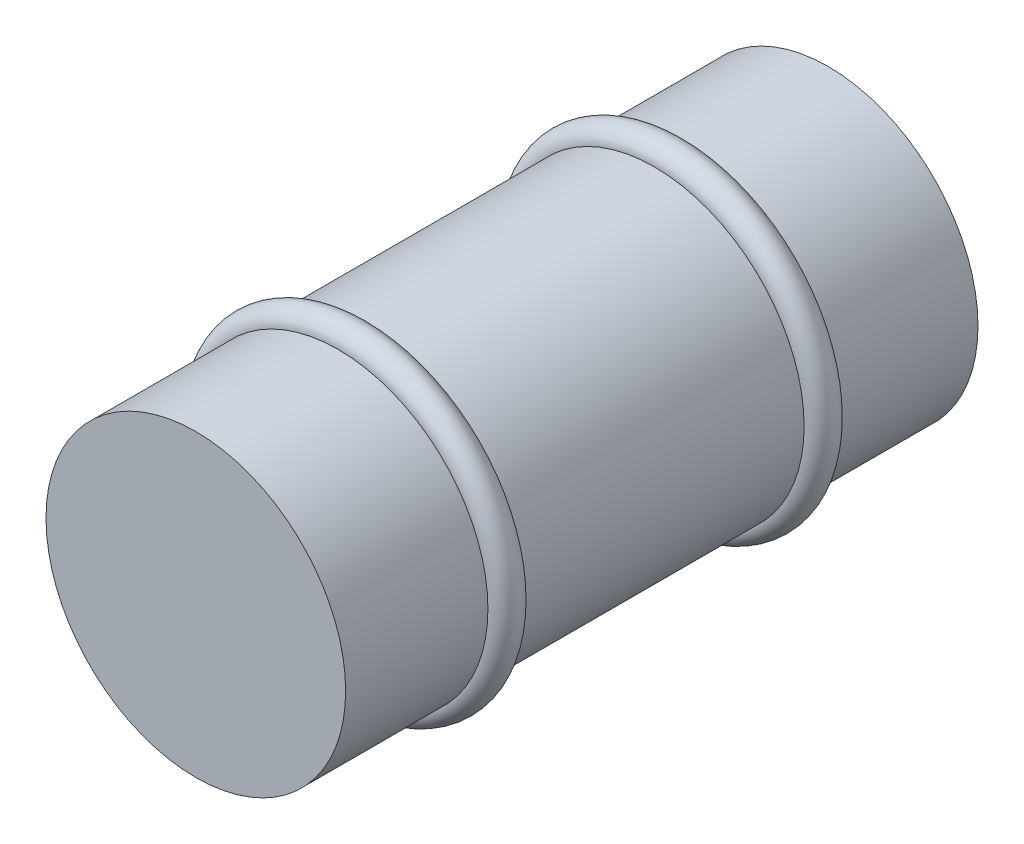
ISO-10303-21;
HEADER;
FILE_DESCRIPTION(('STEP AP214'),'2;1');
FILE_NAME('part.step','',(''),(''),'','','');
FILE_SCHEMA(('AUTOMOTIVE_DESIGN { 1 0 10303 214 1 1 1 1 }'));
ENDSEC;
DATA;
#1=APPLICATION_CONTEXT('core data for automotive mechanical design processes');
#2=APPLICATION_PROTOCOL_DEFINITION('international standard','automotive_design',2000,#1);
#3=PRODUCT_CONTEXT('',#1,'mechanical');
#4=PRODUCT('Part','Part','',(#3));
#5=PRODUCT_RELATED_PRODUCT_CATEGORY('part','',(#4));
#6=PRODUCT_DEFINITION_FORMATION('','',#4);
#7=PRODUCT_DEFINITION_CONTEXT('part definition',#1,'design');
#8=PRODUCT_DEFINITION('design','',#6,#7);
#9=PRODUCT_DEFINITION_SHAPE('','',#8);
#10=(LENGTH_UNIT() NAMED_UNIT(*) SI_UNIT(.MILLI.,.METRE.));
#11=(NAMED_UNIT(*) PLANE_ANGLE_UNIT() SI_UNIT($,.RADIAN.));
#12=(NAMED_UNIT(*) SI_UNIT($,.STERADIAN.) SOLID_ANGLE_UNIT());
#13=UNCERTAINTY_MEASURE_WITH_UNIT(LENGTH_MEASURE(1.E-05),#10,'distance_accuracy_value','');
#14=(GEOMETRIC_REPRESENTATION_CONTEXT(3) GLOBAL_UNCERTAINTY_ASSIGNED_CONTEXT((#13)) GLOBAL_UNIT_ASSIGNED_CONTEXT((#10,
#11,#12)) REPRESENTATION_CONTEXT('',''));
#15=CARTESIAN_POINT('',(0.,0.,0.));
#16=DIRECTION('',(0.,0.,1.));
#17=DIRECTION('',(1.,0.,0.));
#18=AXIS2_PLACEMENT_3D('',#15,#16,#17);
#19=CARTESIAN_POINT('',(0.,0.,25.));
#20=DIRECTION('',(0.,0.,1.));
#21=DIRECTION('',(1.,0.,0.));
#22=AXIS2_PLACEMENT_3D('',#19,#20,#21);
#23=TOROIDAL_SURFACE('',#22,23.6929461454703,2.5);
#24=CARTESIAN_POINT('',(23.6929461454703,0.,25.));
#25=DIRECTION('',(0.,1.,0.));
#26=DIRECTION('',(0.,0.,1.));
#27=AXIS2_PLACEMENT_3D('',#24,#25,#26);
#28=CIRCLE('',#27,2.5);
#29=CARTESIAN_POINT('',(26.1929461454703,0.,25.));
#30=VERTEX_POINT('',#29);
#31=EDGE_CURVE('E11',#30,#30,#28,.T.);
#32=CARTESIAN_POINT('',(0.,0.,25.));
#33=DIRECTION('',(0.,0.,1.));
#34=DIRECTION('',(1.,0.,0.));
#35=AXIS2_PLACEMENT_3D('',#32,#33,#34);
#36=CIRCLE('',#35,26.1929461454703);
#37=EDGE_CURVE('',#30,#30,#36,.T.);
#38=ORIENTED_EDGE('',*,*,#31,.T.);
#39=ORIENTED_EDGE('',*,*,#31,.F.);
#40=ORIENTED_EDGE('',*,*,#37,.T.);
#41=ORIENTED_EDGE('',*,*,#37,.F.);
#42=EDGE_LOOP('',(#38,#40,#39,#41));
#43=FACE_BOUND('',#42,.T.);
#44=ADVANCED_FACE('F42',(#43),#23,.T.);
#45=CLOSED_SHELL('',(#44));
#46=MANIFOLD_SOLID_BREP('B2',#45);
#47=CARTESIAN_POINT('',(0.,0.,75.));
#48=DIRECTION('',(0.,0.,1.));
#49=DIRECTION('',(1.,0.,0.));
#50=AXIS2_PLACEMENT_3D('',#47,#48,#49);
#51=TOROIDAL_SURFACE('',#50,23.6929461454703,2.5);
#52=CARTESIAN_POINT('',(23.6929461454703,0.,75.));
#53=DIRECTION('',(0.,1.,0.));
#54=DIRECTION('',(0.,0.,1.));
#55=AXIS2_PLACEMENT_3D('',#52,#53,#54);
#56=CIRCLE('',#55,2.5);
#57=CARTESIAN_POINT('',(26.1929461454703,0.,75.));
#58=VERTEX_POINT('',#57);
#59=EDGE_CURVE('E41',#58,#58,#56,.T.);
#60=CARTESIAN_POINT('',(0.,0.,75.));
#61=DIRECTION('',(0.,0.,1.));
#62=DIRECTION('',(1.,0.,0.));
#63=AXIS2_PLACEMENT_3D('',#60,#61,#62);
#64=CIRCLE('',#63,26.1929461454703);
#65=EDGE_CURVE('',#58,#58,#64,.T.);
#66=ORIENTED_EDGE('',*,*,#59,.T.);
#67=ORIENTED_EDGE('',*,*,#59,.F.);
#68=ORIENTED_EDGE('',*,*,#65,.T.);
#69=ORIENTED_EDGE('',*,*,#65,.F.);
#70=EDGE_LOOP('',(#66,#68,#67,#69));
#71=FACE_BOUND('',#70,.T.);
#72=ADVANCED_FACE('F70',(#71),#51,.T.);
#73=CLOSED_SHELL('',(#72));
#74=MANIFOLD_SOLID_BREP('B6',#73);
#75=CARTESIAN_POINT('',(0.,0.,100.));
#76=DIRECTION('',(0.,0.,-1.));
#77=DIRECTION('',(-1.,0.,0.));
#78=AXIS2_PLACEMENT_3D('',#75,#76,#77);
#79=CYLINDRICAL_SURFACE('',#78,23.6929461454703);
#80=CARTESIAN_POINT('',(0.,0.,77.5));
#81=DIRECTION('',(0.,0.,-1.));
#82=DIRECTION('',(-1.,0.,0.));
#83=AXIS2_PLACEMENT_3D('',#80,#81,#82);
#84=CIRCLE('',#83,23.6929461454703);
#85=CARTESIAN_POINT('',(23.6929461454703,0.,77.5));
#86=VERTEX_POINT('',#85);
#87=EDGE_CURVE('E68',#86,#86,#84,.F.);
#88=ORIENTED_EDGE('',*,*,#87,.T.);
#89=EDGE_LOOP('',(#88));
#90=FACE_BOUND('',#89,.T.);
#91=CARTESIAN_POINT('',(0.,0.,100.));
#92=DIRECTION('',(0.,0.,1.));
#93=DIRECTION('',(1.,0.,0.));
#94=AXIS2_PLACEMENT_3D('',#91,#92,#93);
#95=CIRCLE('',#94,23.6929461454703);
#96=CARTESIAN_POINT('',(23.6929461454703,0.,100.));
#97=VERTEX_POINT('',#96);
#98=EDGE_CURVE('E108',#97,#97,#95,.T.);
#99=ORIENTED_EDGE('',*,*,#98,.F.);
#100=EDGE_LOOP('',(#99));
#101=FACE_BOUND('',#100,.T.);
#102=ADVANCED_FACE('F87',(#90,#101),#79,.T.);
#103=CARTESIAN_POINT('',(0.,0.,100.));
#104=DIRECTION('',(0.,0.,1.));
#105=DIRECTION('',(1.,0.,0.));
#106=AXIS2_PLACEMENT_3D('',#103,#104,#105);
#107=PLANE('',#106);
#108=ORIENTED_EDGE('',*,*,#98,.T.);
#109=EDGE_LOOP('',(#108));
#110=FACE_BOUND('',#109,.T.);
#111=ADVANCED_FACE('F122',(#110),#107,.T.);
#112=CARTESIAN_POINT('',(0.,0.,75.));
#113=DIRECTION('',(0.,0.,1.));
#114=DIRECTION('',(1.,0.,0.));
#115=AXIS2_PLACEMENT_3D('',#112,#113,#114);
#116=TOROIDAL_SURFACE('',#115,23.6929461454703,2.5);
#117=CARTESIAN_POINT('',(23.6929461454703,0.,75.));
#118=DIRECTION('',(0.,1.,0.));
#119=DIRECTION('',(0.,0.,1.));
#120=AXIS2_PLACEMENT_3D('',#117,#118,#119);
#121=CIRCLE('',#120,2.5);
#122=CARTESIAN_POINT('',(23.6929461454703,0.,72.5));
#123=VERTEX_POINT('',#122);
#124=EDGE_CURVE('E102',#123,#86,#121,.T.);
#125=ORIENTED_EDGE('',*,*,#124,.F.);
#126=CARTESIAN_POINT('',(0.,0.,72.5));
#127=DIRECTION('',(0.,0.,1.));
#128=DIRECTION('',(1.,0.,0.));
#129=AXIS2_PLACEMENT_3D('',#126,#127,#128);
#130=CIRCLE('',#129,23.6929461454703);
#131=EDGE_CURVE('E95',#123,#123,#130,.F.);
#132=ORIENTED_EDGE('',*,*,#131,.F.);
#133=ORIENTED_EDGE('',*,*,#124,.T.);
#134=ORIENTED_EDGE('',*,*,#87,.F.);
#135=EDGE_LOOP('',(#125,#132,#133,#134));
#136=FACE_BOUND('',#135,.T.);
#137=ADVANCED_FACE('F103',(#136),#116,.F.);
#138=CARTESIAN_POINT('',(0.,0.,0.));
#139=DIRECTION('',(0.,0.,1.));
#140=DIRECTION('',(1.,0.,0.));
#141=AXIS2_PLACEMENT_3D('',#138,#139,#140);
#142=PLANE('',#141);
#143=CARTESIAN_POINT('',(0.,0.,0.));
#144=DIRECTION('',(0.,0.,1.));
#145=DIRECTION('',(1.,0.,0.));
#146=AXIS2_PLACEMENT_3D('',#143,#144,#145);
#147=CIRCLE('',#146,23.6929461454703);
#148=CARTESIAN_POINT('',(23.6929461454703,0.,0.));
#149=VERTEX_POINT('',#148);
#150=EDGE_CURVE('E105',#149,#149,#147,.T.);
#151=ORIENTED_EDGE('',*,*,#150,.F.);
#152=EDGE_LOOP('',(#151));
#153=FACE_BOUND('',#152,.T.);
#154=ADVANCED_FACE('F115',(#153),#142,.F.);
#155=ORIENTED_EDGE('',*,*,#131,.T.);
#156=EDGE_LOOP('',(#155));
#157=FACE_BOUND('',#156,.T.);
#158=ORIENTED_EDGE('',*,*,#150,.T.);
#159=EDGE_LOOP('',(#158));
#160=FACE_BOUND('',#159,.T.);
#161=ADVANCED_FACE('F89',(#157,#160),#79,.T.);
#162=CLOSED_SHELL('',(#102,#111,#137,#154,#161));
#163=MANIFOLD_SOLID_BREP('B36',#162);
#164=ADVANCED_BREP_SHAPE_REPRESENTATION('',(#18,#46,#74,#163),#14);
#165=SHAPE_DEFINITION_REPRESENTATION(#9,#164);
ENDSEC;
END-ISO-10303-21;
